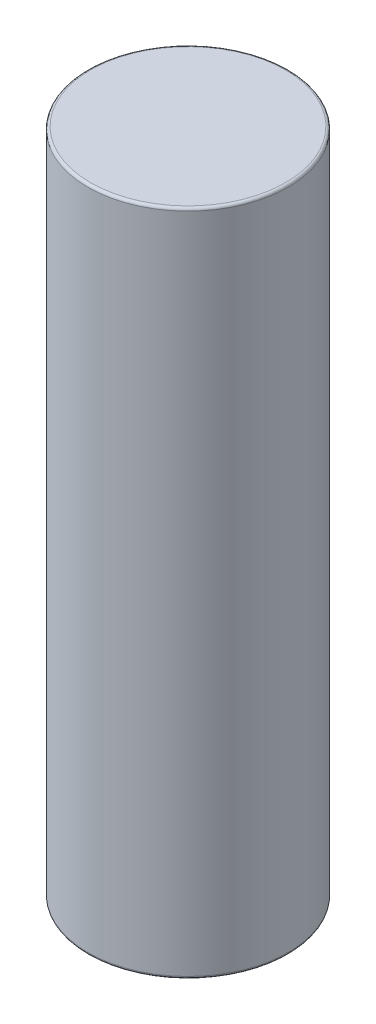
ISO-10303-21;
HEADER;
FILE_DESCRIPTION(('STEP AP214'),'2;1');
FILE_NAME('part.step','',(''),(''),'','','');
FILE_SCHEMA(('AUTOMOTIVE_DESIGN { 1 0 10303 214 1 1 1 1 }'));
ENDSEC;
DATA;
#1=APPLICATION_CONTEXT('core data for automotive mechanical design processes');
#2=APPLICATION_PROTOCOL_DEFINITION('international standard','automotive_design',2000,#1);
#3=PRODUCT_CONTEXT('',#1,'mechanical');
#4=PRODUCT('Part','Part','',(#3));
#5=PRODUCT_RELATED_PRODUCT_CATEGORY('part','',(#4));
#6=PRODUCT_DEFINITION_FORMATION('','',#4);
#7=PRODUCT_DEFINITION_CONTEXT('part definition',#1,'design');
#8=PRODUCT_DEFINITION('design','',#6,#7);
#9=PRODUCT_DEFINITION_SHAPE('','',#8);
#10=(LENGTH_UNIT() NAMED_UNIT(*) SI_UNIT(.MILLI.,.METRE.));
#11=(NAMED_UNIT(*) PLANE_ANGLE_UNIT() SI_UNIT($,.RADIAN.));
#12=(NAMED_UNIT(*) SI_UNIT($,.STERADIAN.) SOLID_ANGLE_UNIT());
#13=UNCERTAINTY_MEASURE_WITH_UNIT(LENGTH_MEASURE(1.E-05),#10,'distance_accuracy_value','');
#14=(GEOMETRIC_REPRESENTATION_CONTEXT(3) GLOBAL_UNCERTAINTY_ASSIGNED_CONTEXT((#13)) GLOBAL_UNIT_ASSIGNED_CONTEXT((#10,
#11,#12)) REPRESENTATION_CONTEXT('',''));
#15=CARTESIAN_POINT('',(0.,0.,0.));
#16=DIRECTION('',(0.,0.,1.));
#17=DIRECTION('',(1.,0.,0.));
#18=AXIS2_PLACEMENT_3D('',#15,#16,#17);
#19=CARTESIAN_POINT('',(0.,100.,0.));
#20=DIRECTION('',(0.,-1.,0.));
#21=DIRECTION('',(0.,0.,-1.));
#22=AXIS2_PLACEMENT_3D('',#19,#20,#21);
#23=CYLINDRICAL_SURFACE('',#22,15.);
#24=CARTESIAN_POINT('',(0.,0.399999999999998,0.));
#25=DIRECTION('',(0.,1.,0.));
#26=DIRECTION('',(0.,0.,1.));
#27=AXIS2_PLACEMENT_3D('',#24,#25,#26);
#28=CIRCLE('',#27,15.);
#29=CARTESIAN_POINT('',(0.,0.399999999999998,15.));
#30=VERTEX_POINT('',#29);
#31=EDGE_CURVE('E56',#30,#30,#28,.T.);
#32=ORIENTED_EDGE('',*,*,#31,.T.);
#33=EDGE_LOOP('',(#32));
#34=FACE_BOUND('',#33,.T.);
#35=CARTESIAN_POINT('',(0.,99.6,0.));
#36=DIRECTION('',(0.,1.,0.));
#37=DIRECTION('',(0.,0.,1.));
#38=AXIS2_PLACEMENT_3D('',#35,#36,#37);
#39=CIRCLE('',#38,15.);
#40=CARTESIAN_POINT('',(0.,99.6,15.));
#41=VERTEX_POINT('',#40);
#42=EDGE_CURVE('E61',#41,#41,#39,.F.);
#43=ORIENTED_EDGE('',*,*,#42,.T.);
#44=EDGE_LOOP('',(#43));
#45=FACE_BOUND('',#44,.T.);
#46=ADVANCED_FACE('F43',(#34,#45),#23,.T.);
#47=CARTESIAN_POINT('',(0.,100.,0.));
#48=DIRECTION('',(0.,1.,0.));
#49=DIRECTION('',(0.,0.,1.));
#50=AXIS2_PLACEMENT_3D('',#47,#48,#49);
#51=PLANE('',#50);
#52=CARTESIAN_POINT('',(0.,100.,0.));
#53=DIRECTION('',(0.,1.,0.));
#54=DIRECTION('',(0.,0.,1.));
#55=AXIS2_PLACEMENT_3D('',#52,#53,#54);
#56=CIRCLE('',#55,14.6);
#57=CARTESIAN_POINT('',(0.,100.,14.6));
#58=VERTEX_POINT('',#57);
#59=EDGE_CURVE('E10',#58,#58,#56,.T.);
#60=ORIENTED_EDGE('',*,*,#59,.T.);
#61=EDGE_LOOP('',(#60));
#62=FACE_BOUND('',#61,.T.);
#63=ADVANCED_FACE('F78',(#62),#51,.T.);
#64=CARTESIAN_POINT('',(0.,0.,0.));
#65=DIRECTION('',(0.,1.,0.));
#66=DIRECTION('',(0.,0.,1.));
#67=AXIS2_PLACEMENT_3D('',#64,#65,#66);
#68=PLANE('',#67);
#69=CARTESIAN_POINT('',(0.,0.,0.));
#70=DIRECTION('',(0.,1.,0.));
#71=DIRECTION('',(0.,0.,1.));
#72=AXIS2_PLACEMENT_3D('',#69,#70,#71);
#73=CIRCLE('',#72,14.6);
#74=CARTESIAN_POINT('',(0.,0.,14.6));
#75=VERTEX_POINT('',#74);
#76=EDGE_CURVE('E51',#75,#75,#73,.F.);
#77=ORIENTED_EDGE('',*,*,#76,.T.);
#78=EDGE_LOOP('',(#77));
#79=FACE_BOUND('',#78,.T.);
#80=ADVANCED_FACE('F75',(#79),#68,.F.);
#81=CARTESIAN_POINT('',(0.,0.399999999999998,0.));
#82=DIRECTION('',(0.,1.,0.));
#83=DIRECTION('',(0.,0.,1.));
#84=AXIS2_PLACEMENT_3D('',#81,#82,#83);
#85=TOROIDAL_SURFACE('',#84,14.6,0.4);
#86=ORIENTED_EDGE('',*,*,#76,.F.);
#87=EDGE_LOOP('',(#86));
#88=FACE_BOUND('',#87,.T.);
#89=ORIENTED_EDGE('',*,*,#31,.F.);
#90=EDGE_LOOP('',(#89));
#91=FACE_BOUND('',#90,.T.);
#92=ADVANCED_FACE('F71',(#88,#91),#85,.T.);
#93=CARTESIAN_POINT('',(0.,99.6,0.));
#94=DIRECTION('',(0.,1.,0.));
#95=DIRECTION('',(0.,0.,1.));
#96=AXIS2_PLACEMENT_3D('',#93,#94,#95);
#97=TOROIDAL_SURFACE('',#96,14.6,0.4);
#98=ORIENTED_EDGE('',*,*,#42,.F.);
#99=EDGE_LOOP('',(#98));
#100=FACE_BOUND('',#99,.T.);
#101=ORIENTED_EDGE('',*,*,#59,.F.);
#102=EDGE_LOOP('',(#101));
#103=FACE_BOUND('',#102,.T.);
#104=ADVANCED_FACE('F45',(#100,#103),#97,.T.);
#105=CLOSED_SHELL('',(#46,#63,#80,#92,#104));
#106=MANIFOLD_SOLID_BREP('B2',#105);
#107=ADVANCED_BREP_SHAPE_REPRESENTATION('',(#18,#106),#14);
#108=SHAPE_DEFINITION_REPRESENTATION(#9,#107);
ENDSEC;
END-ISO-10303-21;
